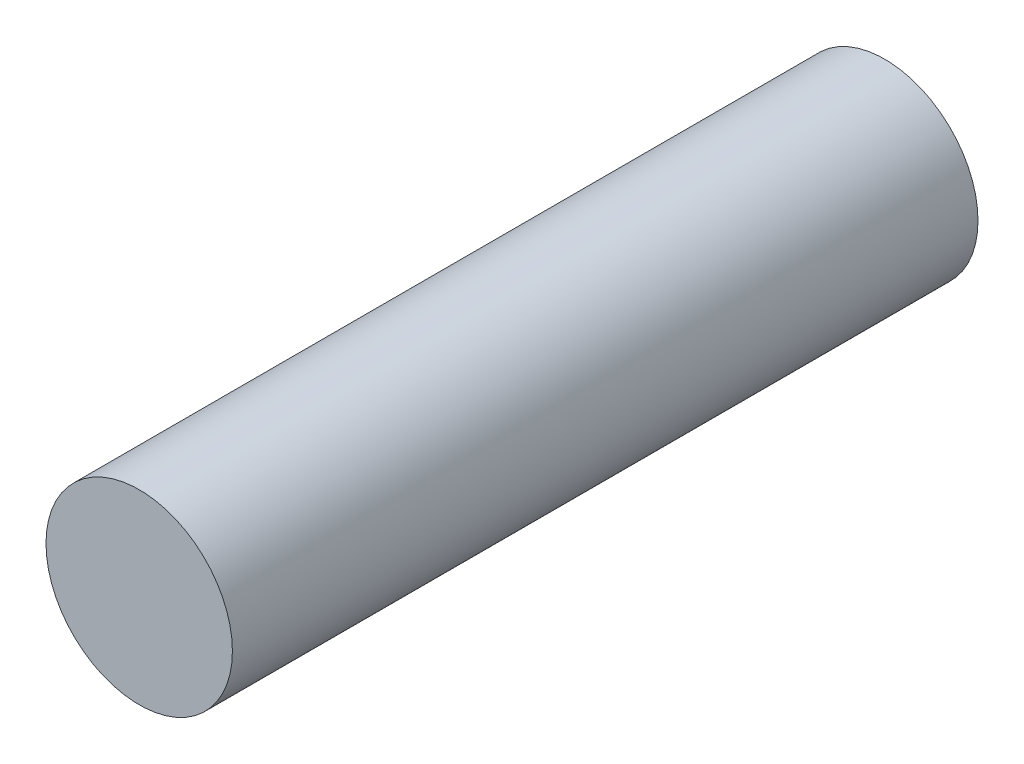
ISO-10303-21;
HEADER;
FILE_DESCRIPTION(('STEP AP214'),'2;1');
FILE_NAME('part.step','',(''),(''),'','','');
FILE_SCHEMA(('AUTOMOTIVE_DESIGN { 1 0 10303 214 1 1 1 1 }'));
ENDSEC;
DATA;
#1=APPLICATION_CONTEXT('core data for automotive mechanical design processes');
#2=APPLICATION_PROTOCOL_DEFINITION('international standard','automotive_design',2000,#1);
#3=PRODUCT_CONTEXT('',#1,'mechanical');
#4=PRODUCT('Part','Part','',(#3));
#5=PRODUCT_RELATED_PRODUCT_CATEGORY('part','',(#4));
#6=PRODUCT_DEFINITION_FORMATION('','',#4);
#7=PRODUCT_DEFINITION_CONTEXT('part definition',#1,'design');
#8=PRODUCT_DEFINITION('design','',#6,#7);
#9=PRODUCT_DEFINITION_SHAPE('','',#8);
#10=(LENGTH_UNIT() NAMED_UNIT(*) SI_UNIT(.MILLI.,.METRE.));
#11=(NAMED_UNIT(*) PLANE_ANGLE_UNIT() SI_UNIT($,.RADIAN.));
#12=(NAMED_UNIT(*) SI_UNIT($,.STERADIAN.) SOLID_ANGLE_UNIT());
#13=UNCERTAINTY_MEASURE_WITH_UNIT(LENGTH_MEASURE(1.E-05),#10,'distance_accuracy_value','');
#14=(GEOMETRIC_REPRESENTATION_CONTEXT(3) GLOBAL_UNCERTAINTY_ASSIGNED_CONTEXT((#13)) GLOBAL_UNIT_ASSIGNED_CONTEXT((#10,
#11,#12)) REPRESENTATION_CONTEXT('',''));
#15=CARTESIAN_POINT('',(0.,0.,0.));
#16=DIRECTION('',(0.,0.,1.));
#17=DIRECTION('',(1.,0.,0.));
#18=AXIS2_PLACEMENT_3D('',#15,#16,#17);
#19=CARTESIAN_POINT('',(0.,0.,25.4));
#20=DIRECTION('',(0.,0.,-1.));
#21=DIRECTION('',(-1.,0.,0.));
#22=AXIS2_PLACEMENT_3D('',#19,#20,#21);
#23=CYLINDRICAL_SURFACE('',#22,3.175);
#24=CARTESIAN_POINT('',(0.,0.,25.4));
#25=DIRECTION('',(0.,0.,1.));
#26=DIRECTION('',(1.,0.,0.));
#27=AXIS2_PLACEMENT_3D('',#24,#25,#26);
#28=CIRCLE('',#27,3.175);
#29=CARTESIAN_POINT('',(3.175,0.,25.4));
#30=VERTEX_POINT('',#29);
#31=EDGE_CURVE('E10',#30,#30,#28,.T.);
#32=ORIENTED_EDGE('',*,*,#31,.F.);
#33=EDGE_LOOP('',(#32));
#34=FACE_BOUND('',#33,.T.);
#35=CARTESIAN_POINT('',(0.,0.,0.));
#36=DIRECTION('',(0.,0.,1.));
#37=DIRECTION('',(1.,0.,0.));
#38=AXIS2_PLACEMENT_3D('',#35,#36,#37);
#39=CIRCLE('',#38,3.175);
#40=CARTESIAN_POINT('',(3.175,0.,0.));
#41=VERTEX_POINT('',#40);
#42=EDGE_CURVE('E44',#41,#41,#39,.T.);
#43=ORIENTED_EDGE('',*,*,#42,.T.);
#44=EDGE_LOOP('',(#43));
#45=FACE_BOUND('',#44,.T.);
#46=ADVANCED_FACE('F41',(#34,#45),#23,.T.);
#47=CARTESIAN_POINT('',(0.,0.,25.4));
#48=DIRECTION('',(0.,0.,1.));
#49=DIRECTION('',(1.,0.,0.));
#50=AXIS2_PLACEMENT_3D('',#47,#48,#49);
#51=PLANE('',#50);
#52=ORIENTED_EDGE('',*,*,#31,.T.);
#53=EDGE_LOOP('',(#52));
#54=FACE_BOUND('',#53,.T.);
#55=ADVANCED_FACE('F58',(#54),#51,.T.);
#56=CARTESIAN_POINT('',(0.,0.,0.));
#57=DIRECTION('',(0.,0.,1.));
#58=DIRECTION('',(1.,0.,0.));
#59=AXIS2_PLACEMENT_3D('',#56,#57,#58);
#60=PLANE('',#59);
#61=ORIENTED_EDGE('',*,*,#42,.F.);
#62=EDGE_LOOP('',(#61));
#63=FACE_BOUND('',#62,.T.);
#64=ADVANCED_FACE('F56',(#63),#60,.F.);
#65=CLOSED_SHELL('',(#46,#55,#64));
#66=MANIFOLD_SOLID_BREP('B2',#65);
#67=ADVANCED_BREP_SHAPE_REPRESENTATION('',(#18,#66),#14);
#68=SHAPE_DEFINITION_REPRESENTATION(#9,#67);
ENDSEC;
END-ISO-10303-21;
